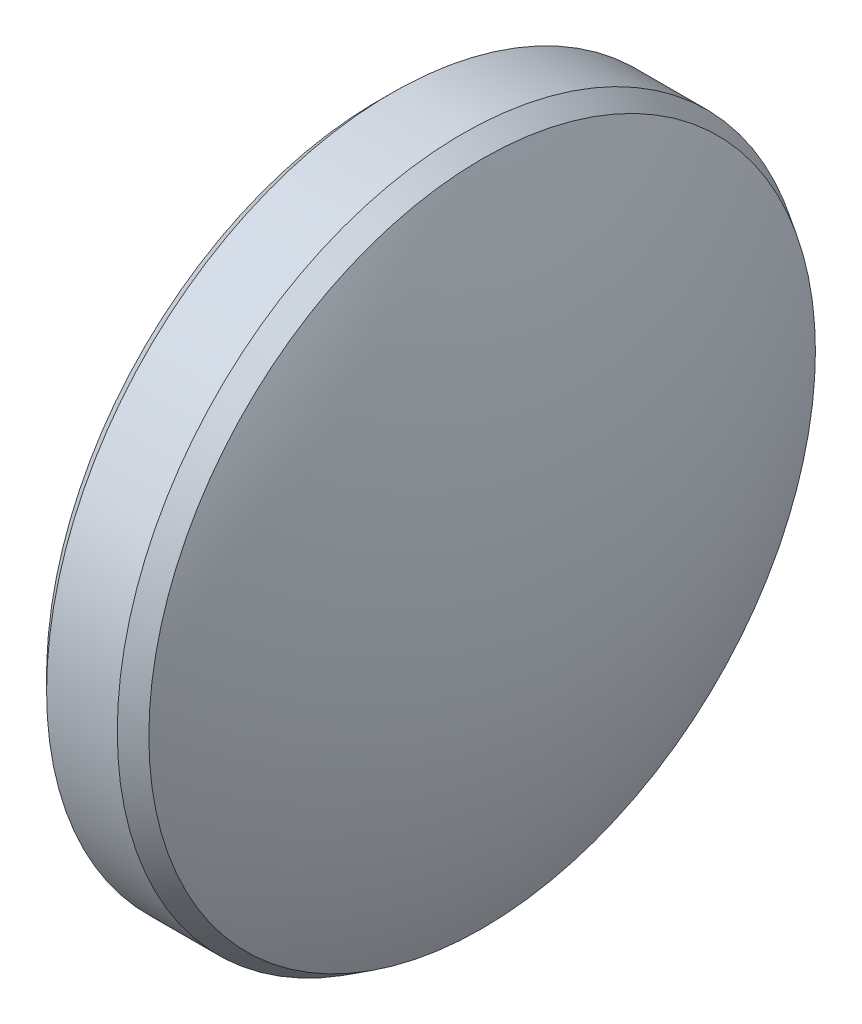
ISO-10303-21;
HEADER;
FILE_DESCRIPTION(('STEP AP214'),'2;1');
FILE_NAME('part.step','',(''),(''),'','','');
FILE_SCHEMA(('AUTOMOTIVE_DESIGN { 1 0 10303 214 1 1 1 1 }'));
ENDSEC;
DATA;
#1=APPLICATION_CONTEXT('core data for automotive mechanical design processes');
#2=APPLICATION_PROTOCOL_DEFINITION('international standard','automotive_design',2000,#1);
#3=PRODUCT_CONTEXT('',#1,'mechanical');
#4=PRODUCT('Part','Part','',(#3));
#5=PRODUCT_RELATED_PRODUCT_CATEGORY('part','',(#4));
#6=PRODUCT_DEFINITION_FORMATION('','',#4);
#7=PRODUCT_DEFINITION_CONTEXT('part definition',#1,'design');
#8=PRODUCT_DEFINITION('design','',#6,#7);
#9=PRODUCT_DEFINITION_SHAPE('','',#8);
#10=(LENGTH_UNIT() NAMED_UNIT(*) SI_UNIT(.MILLI.,.METRE.));
#11=(NAMED_UNIT(*) PLANE_ANGLE_UNIT() SI_UNIT($,.RADIAN.));
#12=(NAMED_UNIT(*) SI_UNIT($,.STERADIAN.) SOLID_ANGLE_UNIT());
#13=UNCERTAINTY_MEASURE_WITH_UNIT(LENGTH_MEASURE(1.E-05),#10,'distance_accuracy_value','');
#14=(GEOMETRIC_REPRESENTATION_CONTEXT(3) GLOBAL_UNCERTAINTY_ASSIGNED_CONTEXT((#13)) GLOBAL_UNIT_ASSIGNED_CONTEXT((#10,
#11,#12)) REPRESENTATION_CONTEXT('',''));
#15=CARTESIAN_POINT('',(0.,0.,0.));
#16=DIRECTION('',(0.,0.,1.));
#17=DIRECTION('',(1.,0.,0.));
#18=AXIS2_PLACEMENT_3D('',#15,#16,#17);
#19=CARTESIAN_POINT('',(-1.65,0.,0.));
#20=DIRECTION('',(1.,0.,0.));
#21=DIRECTION('',(0.,0.,-1.));
#22=AXIS2_PLACEMENT_3D('',#19,#20,#21);
#23=PLANE('',#22);
#24=CARTESIAN_POINT('',(-1.65,0.,0.));
#25=DIRECTION('',(1.,0.,0.));
#26=DIRECTION('',(0.,0.,-1.));
#27=AXIS2_PLACEMENT_3D('',#24,#25,#26);
#28=CIRCLE('',#27,6.1);
#29=CARTESIAN_POINT('',(-1.65,0.,-6.1));
#30=VERTEX_POINT('',#29);
#31=EDGE_CURVE('E46',#30,#30,#28,.F.);
#32=ORIENTED_EDGE('',*,*,#31,.T.);
#33=EDGE_LOOP('',(#32));
#34=FACE_BOUND('',#33,.T.);
#35=ADVANCED_FACE('F15',(#34),#23,.F.);
#36=CARTESIAN_POINT('',(-1.65,0.,0.));
#37=DIRECTION('',(-1.,0.,0.));
#38=DIRECTION('',(0.,0.,1.));
#39=AXIS2_PLACEMENT_3D('',#36,#37,#38);
#40=CYLINDRICAL_SURFACE('',#39,6.35);
#41=CARTESIAN_POINT('',(-1.4,0.,0.));
#42=DIRECTION('',(1.,0.,0.));
#43=DIRECTION('',(0.,0.,-1.));
#44=AXIS2_PLACEMENT_3D('',#41,#42,#43);
#45=CIRCLE('',#44,6.35);
#46=CARTESIAN_POINT('',(-1.4,0.,-6.35));
#47=VERTEX_POINT('',#46);
#48=EDGE_CURVE('E22',#47,#47,#45,.T.);
#49=ORIENTED_EDGE('',*,*,#48,.T.);
#50=EDGE_LOOP('',(#49));
#51=FACE_BOUND('',#50,.T.);
#52=CARTESIAN_POINT('',(-0.0999999999999959,0.,0.));
#53=DIRECTION('',(-1.,0.,0.));
#54=DIRECTION('',(0.,0.,1.));
#55=AXIS2_PLACEMENT_3D('',#52,#53,#54);
#56=CIRCLE('',#55,6.35);
#57=CARTESIAN_POINT('',(-0.0999999999999959,0.,6.35));
#58=VERTEX_POINT('',#57);
#59=EDGE_CURVE('E48',#58,#58,#56,.T.);
#60=ORIENTED_EDGE('',*,*,#59,.T.);
#61=EDGE_LOOP('',(#60));
#62=FACE_BOUND('',#61,.T.);
#63=ADVANCED_FACE('F28',(#51,#62),#40,.T.);
#64=CARTESIAN_POINT('',(-12.1496906848465,0.,0.0923959012173702));
#65=DIRECTION('',(0.,-1.,0.));
#66=DIRECTION('',(0.,0.,1.));
#67=AXIS2_PLACEMENT_3D('',#64,#65,#66);
#68=CIRCLE('',#67,13.8);
#69=TRIMMED_CURVE('',#68,(PARAMETER_VALUE(-1.57749173197957)),
(PARAMETER_VALUE(1.57749173197957)),.T.,.PARAMETER.);
#70=CARTESIAN_POINT('',(-12.1496906848465,0.,0.));
#71=DIRECTION('',(-1.,0.,0.));
#72=AXIS1_PLACEMENT('',#70,#71);
#73=SURFACE_OF_REVOLUTION('',#69,#72);
#74=CARTESIAN_POINT('',(0.259774540184672,0.,0.));
#75=DIRECTION('',(-1.,0.,0.));
#76=DIRECTION('',(0.,0.,1.));
#77=AXIS2_PLACEMENT_3D('',#74,#75,#76);
#78=CIRCLE('',#77,6.12937965378313);
#79=CARTESIAN_POINT('',(0.259774540184672,0.,6.12937965378313));
#80=VERTEX_POINT('',#79);
#81=EDGE_CURVE('E10',#80,#80,#78,.F.);
#82=ORIENTED_EDGE('',*,*,#81,.T.);
#83=EDGE_LOOP('',(#82));
#84=FACE_BOUND('',#83,.T.);
#85=CARTESIAN_POINT('',(1.65,0.,0.));
#86=VERTEX_POINT('',#85);
#87=VERTEX_LOOP('',#86);
#88=FACE_BOUND('',#87,.T.);
#89=ADVANCED_FACE('F25',(#84,#88),#73,.T.);
#90=CARTESIAN_POINT('',(-1.65,0.,0.));
#91=DIRECTION('',(1.,0.,0.));
#92=DIRECTION('',(0.,0.,-1.));
#93=AXIS2_PLACEMENT_3D('',#90,#91,#92);
#94=CONICAL_SURFACE('',#93,6.1,0.78539816339745);
#95=ORIENTED_EDGE('',*,*,#48,.F.);
#96=EDGE_LOOP('',(#95));
#97=FACE_BOUND('',#96,.T.);
#98=ORIENTED_EDGE('',*,*,#31,.F.);
#99=EDGE_LOOP('',(#98));
#100=FACE_BOUND('',#99,.T.);
#101=ADVANCED_FACE('F27',(#97,#100),#94,.T.);
#102=CARTESIAN_POINT('',(-0.0999999999999959,0.,0.));
#103=DIRECTION('',(-1.,0.,0.));
#104=DIRECTION('',(0.,0.,1.));
#105=AXIS2_PLACEMENT_3D('',#102,#103,#104);
#106=CONICAL_SURFACE('',#105,6.35,0.550082215949468);
#107=ORIENTED_EDGE('',*,*,#81,.F.);
#108=EDGE_LOOP('',(#107));
#109=FACE_BOUND('',#108,.T.);
#110=ORIENTED_EDGE('',*,*,#59,.F.);
#111=EDGE_LOOP('',(#110));
#112=FACE_BOUND('',#111,.T.);
#113=ADVANCED_FACE('F17',(#109,#112),#106,.T.);
#114=CLOSED_SHELL('',(#35,#63,#89,#101,#113));
#115=MANIFOLD_SOLID_BREP('B1',#114);
#116=ADVANCED_BREP_SHAPE_REPRESENTATION('',(#18,#115),#14);
#117=SHAPE_DEFINITION_REPRESENTATION(#9,#116);
ENDSEC;
END-ISO-10303-21;
